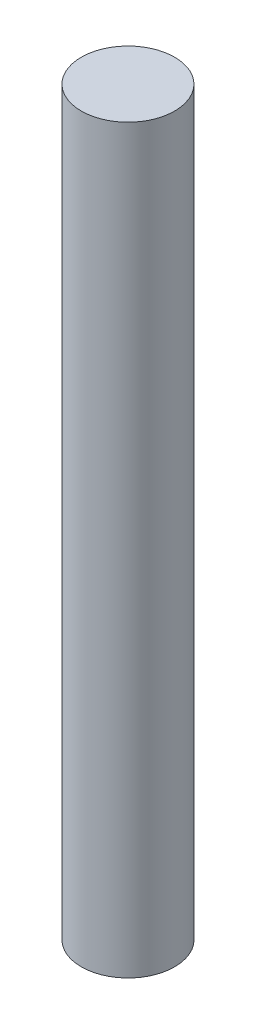
ISO-10303-21;
HEADER;
FILE_DESCRIPTION(('STEP AP214'),'2;1');
FILE_NAME('part.step','',(''),(''),'','','');
FILE_SCHEMA(('AUTOMOTIVE_DESIGN { 1 0 10303 214 1 1 1 1 }'));
ENDSEC;
DATA;
#1=APPLICATION_CONTEXT('core data for automotive mechanical design processes');
#2=APPLICATION_PROTOCOL_DEFINITION('international standard','automotive_design',2000,#1);
#3=PRODUCT_CONTEXT('',#1,'mechanical');
#4=PRODUCT('Part','Part','',(#3));
#5=PRODUCT_RELATED_PRODUCT_CATEGORY('part','',(#4));
#6=PRODUCT_DEFINITION_FORMATION('','',#4);
#7=PRODUCT_DEFINITION_CONTEXT('part definition',#1,'design');
#8=PRODUCT_DEFINITION('design','',#6,#7);
#9=PRODUCT_DEFINITION_SHAPE('','',#8);
#10=(LENGTH_UNIT() NAMED_UNIT(*) SI_UNIT(.MILLI.,.METRE.));
#11=(NAMED_UNIT(*) PLANE_ANGLE_UNIT() SI_UNIT($,.RADIAN.));
#12=(NAMED_UNIT(*) SI_UNIT($,.STERADIAN.) SOLID_ANGLE_UNIT());
#13=UNCERTAINTY_MEASURE_WITH_UNIT(LENGTH_MEASURE(1.E-05),#10,'distance_accuracy_value','');
#14=(GEOMETRIC_REPRESENTATION_CONTEXT(3) GLOBAL_UNCERTAINTY_ASSIGNED_CONTEXT((#13)) GLOBAL_UNIT_ASSIGNED_CONTEXT((#10,
#11,#12)) REPRESENTATION_CONTEXT('',''));
#15=CARTESIAN_POINT('',(0.,0.,0.));
#16=DIRECTION('',(0.,0.,1.));
#17=DIRECTION('',(1.,0.,0.));
#18=AXIS2_PLACEMENT_3D('',#15,#16,#17);
#19=CARTESIAN_POINT('',(0.,63.5,0.));
#20=DIRECTION('',(0.,-1.,0.));
#21=DIRECTION('',(0.,0.,-1.));
#22=AXIS2_PLACEMENT_3D('',#19,#20,#21);
#23=CYLINDRICAL_SURFACE('',#22,4.);
#24=CARTESIAN_POINT('',(0.,63.5,0.));
#25=DIRECTION('',(0.,1.,0.));
#26=DIRECTION('',(0.,0.,1.));
#27=AXIS2_PLACEMENT_3D('',#24,#25,#26);
#28=CIRCLE('',#27,4.);
#29=CARTESIAN_POINT('',(0.,63.5,4.));
#30=VERTEX_POINT('',#29);
#31=EDGE_CURVE('E10',#30,#30,#28,.T.);
#32=ORIENTED_EDGE('',*,*,#31,.F.);
#33=EDGE_LOOP('',(#32));
#34=FACE_BOUND('',#33,.T.);
#35=CARTESIAN_POINT('',(0.,0.,0.));
#36=DIRECTION('',(0.,1.,0.));
#37=DIRECTION('',(0.,0.,1.));
#38=AXIS2_PLACEMENT_3D('',#35,#36,#37);
#39=CIRCLE('',#38,4.);
#40=CARTESIAN_POINT('',(0.,0.,4.));
#41=VERTEX_POINT('',#40);
#42=EDGE_CURVE('E40',#41,#41,#39,.T.);
#43=ORIENTED_EDGE('',*,*,#42,.T.);
#44=EDGE_LOOP('',(#43));
#45=FACE_BOUND('',#44,.T.);
#46=ADVANCED_FACE('F37',(#34,#45),#23,.T.);
#47=CARTESIAN_POINT('',(0.,63.5,0.));
#48=DIRECTION('',(0.,1.,0.));
#49=DIRECTION('',(0.,0.,1.));
#50=AXIS2_PLACEMENT_3D('',#47,#48,#49);
#51=PLANE('',#50);
#52=ORIENTED_EDGE('',*,*,#31,.T.);
#53=EDGE_LOOP('',(#52));
#54=FACE_BOUND('',#53,.T.);
#55=ADVANCED_FACE('F54',(#54),#51,.T.);
#56=CARTESIAN_POINT('',(0.,0.,0.));
#57=DIRECTION('',(0.,1.,0.));
#58=DIRECTION('',(0.,0.,1.));
#59=AXIS2_PLACEMENT_3D('',#56,#57,#58);
#60=PLANE('',#59);
#61=ORIENTED_EDGE('',*,*,#42,.F.);
#62=EDGE_LOOP('',(#61));
#63=FACE_BOUND('',#62,.T.);
#64=ADVANCED_FACE('F52',(#63),#60,.F.);
#65=CLOSED_SHELL('',(#46,#55,#64));
#66=MANIFOLD_SOLID_BREP('B2',#65);
#67=ADVANCED_BREP_SHAPE_REPRESENTATION('',(#18,#66),#14);
#68=SHAPE_DEFINITION_REPRESENTATION(#9,#67);
ENDSEC;
END-ISO-10303-21;
